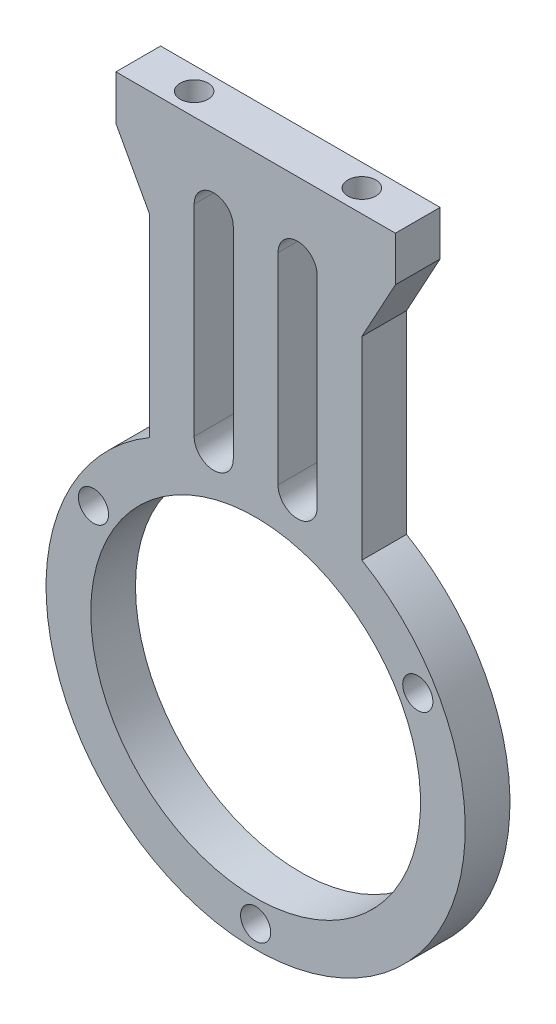
ISO-10303-21;
HEADER;
FILE_DESCRIPTION(('STEP AP214'),'2;1');
FILE_NAME('part.step','',(''),(''),'','','');
FILE_SCHEMA(('AUTOMOTIVE_DESIGN { 1 0 10303 214 1 1 1 1 }'));
ENDSEC;
DATA;
#1=APPLICATION_CONTEXT('core data for automotive mechanical design processes');
#2=APPLICATION_PROTOCOL_DEFINITION('international standard','automotive_design',2000,#1);
#3=PRODUCT_CONTEXT('',#1,'mechanical');
#4=PRODUCT('Part','Part','',(#3));
#5=PRODUCT_RELATED_PRODUCT_CATEGORY('part','',(#4));
#6=PRODUCT_DEFINITION_FORMATION('','',#4);
#7=PRODUCT_DEFINITION_CONTEXT('part definition',#1,'design');
#8=PRODUCT_DEFINITION('design','',#6,#7);
#9=PRODUCT_DEFINITION_SHAPE('','',#8);
#10=(LENGTH_UNIT() NAMED_UNIT(*) SI_UNIT(.MILLI.,.METRE.));
#11=(NAMED_UNIT(*) PLANE_ANGLE_UNIT() SI_UNIT($,.RADIAN.));
#12=(NAMED_UNIT(*) SI_UNIT($,.STERADIAN.) SOLID_ANGLE_UNIT());
#13=UNCERTAINTY_MEASURE_WITH_UNIT(LENGTH_MEASURE(1.E-05),#10,'distance_accuracy_value','');
#14=(GEOMETRIC_REPRESENTATION_CONTEXT(3) GLOBAL_UNCERTAINTY_ASSIGNED_CONTEXT((#13)) GLOBAL_UNIT_ASSIGNED_CONTEXT((#10,
#11,#12)) REPRESENTATION_CONTEXT('',''));
#15=CARTESIAN_POINT('',(0.,0.,0.));
#16=DIRECTION('',(0.,0.,1.));
#17=DIRECTION('',(1.,0.,0.));
#18=AXIS2_PLACEMENT_3D('',#15,#16,#17);
#19=CARTESIAN_POINT('',(7.5,38.,0.));
#20=DIRECTION('',(0.,1.,0.));
#21=DIRECTION('',(0.,0.,1.));
#22=AXIS2_PLACEMENT_3D('',#19,#20,#21);
#23=PLANE('',#22);
#24=CARTESIAN_POINT('',(7.5,38.,0.));
#25=DIRECTION('',(0.,-1.,0.));
#26=DIRECTION('',(0.,0.,-1.));
#27=AXIS2_PLACEMENT_3D('',#24,#25,#26);
#28=CIRCLE('',#27,1.25);
#29=CARTESIAN_POINT('',(7.5,38.,-1.25));
#30=VERTEX_POINT('',#29);
#31=EDGE_CURVE('E28',#30,#30,#28,.F.);
#32=ORIENTED_EDGE('',*,*,#31,.T.);
#33=EDGE_LOOP('',(#32));
#34=FACE_BOUND('',#33,.T.);
#35=ADVANCED_FACE('F25',(#34),#23,.T.);
#36=CARTESIAN_POINT('',(-7.5,38.,0.));
#37=DIRECTION('',(0.,1.,0.));
#38=DIRECTION('',(0.,0.,1.));
#39=AXIS2_PLACEMENT_3D('',#36,#37,#38);
#40=PLANE('',#39);
#41=CARTESIAN_POINT('',(-7.5,38.,0.));
#42=DIRECTION('',(0.,-1.,0.));
#43=DIRECTION('',(0.,0.,-1.));
#44=AXIS2_PLACEMENT_3D('',#41,#42,#43);
#45=CIRCLE('',#44,1.25);
#46=CARTESIAN_POINT('',(-7.5,38.,-1.25));
#47=VERTEX_POINT('',#46);
#48=EDGE_CURVE('E158',#47,#47,#45,.F.);
#49=ORIENTED_EDGE('',*,*,#48,.T.);
#50=EDGE_LOOP('',(#49));
#51=FACE_BOUND('',#50,.T.);
#52=ADVANCED_FACE('F283',(#51),#40,.T.);
#53=CARTESIAN_POINT('',(7.5,43.,0.));
#54=DIRECTION('',(0.,-1.,0.));
#55=DIRECTION('',(0.,0.,-1.));
#56=AXIS2_PLACEMENT_3D('',#53,#54,#55);
#57=CYLINDRICAL_SURFACE('',#56,1.25);
#58=ORIENTED_EDGE('',*,*,#31,.F.);
#59=EDGE_LOOP('',(#58));
#60=FACE_BOUND('',#59,.T.);
#61=CARTESIAN_POINT('',(7.5,43.,0.));
#62=DIRECTION('',(0.,-1.,0.));
#63=DIRECTION('',(0.,0.,-1.));
#64=AXIS2_PLACEMENT_3D('',#61,#62,#63);
#65=CIRCLE('',#64,1.25);
#66=CARTESIAN_POINT('',(7.5,43.,-1.25));
#67=VERTEX_POINT('',#66);
#68=EDGE_CURVE('E270',#67,#67,#65,.T.);
#69=ORIENTED_EDGE('',*,*,#68,.F.);
#70=EDGE_LOOP('',(#69));
#71=FACE_BOUND('',#70,.T.);
#72=ADVANCED_FACE('F279',(#60,#71),#57,.F.);
#73=CARTESIAN_POINT('',(-7.5,43.,0.));
#74=DIRECTION('',(0.,-1.,0.));
#75=DIRECTION('',(0.,0.,-1.));
#76=AXIS2_PLACEMENT_3D('',#73,#74,#75);
#77=CYLINDRICAL_SURFACE('',#76,1.25);
#78=ORIENTED_EDGE('',*,*,#48,.F.);
#79=EDGE_LOOP('',(#78));
#80=FACE_BOUND('',#79,.T.);
#81=CARTESIAN_POINT('',(-7.5,43.,0.));
#82=DIRECTION('',(0.,-1.,0.));
#83=DIRECTION('',(0.,0.,-1.));
#84=AXIS2_PLACEMENT_3D('',#81,#82,#83);
#85=CIRCLE('',#84,1.25);
#86=CARTESIAN_POINT('',(-7.5,43.,-1.25));
#87=VERTEX_POINT('',#86);
#88=EDGE_CURVE('E203',#87,#87,#85,.T.);
#89=ORIENTED_EDGE('',*,*,#88,.F.);
#90=EDGE_LOOP('',(#89));
#91=FACE_BOUND('',#90,.T.);
#92=ADVANCED_FACE('F282',(#80,#91),#77,.F.);
#93=CARTESIAN_POINT('',(0.,12.125,2.));
#94=DIRECTION('',(0.,0.,1.));
#95=DIRECTION('',(1.,0.,0.));
#96=AXIS2_PLACEMENT_3D('',#93,#94,#95);
#97=PLANE('',#96);
#98=DIRECTION('',(0.,1.,0.));
#99=VECTOR('',#98,1.);
#100=CARTESIAN_POINT('',(-5.5,18.25,2.));
#101=LINE('',#100,#99);
#102=CARTESIAN_POINT('',(-5.5,18.25,2.));
#103=VERTEX_POINT('',#102);
#104=CARTESIAN_POINT('',(-5.5,36.25,2.));
#105=VERTEX_POINT('',#104);
#106=EDGE_CURVE('E176',#103,#105,#101,.T.);
#107=ORIENTED_EDGE('',*,*,#106,.T.);
#108=CARTESIAN_POINT('',(-3.75,36.25,2.));
#109=DIRECTION('',(0.,0.,-1.));
#110=DIRECTION('',(-1.,0.,0.));
#111=AXIS2_PLACEMENT_3D('',#108,#109,#110);
#112=CIRCLE('',#111,1.75);
#113=CARTESIAN_POINT('',(-2.,36.25,2.));
#114=VERTEX_POINT('',#113);
#115=EDGE_CURVE('E245',#105,#114,#112,.T.);
#116=ORIENTED_EDGE('',*,*,#115,.T.);
#117=DIRECTION('',(0.,1.,0.));
#118=VECTOR('',#117,1.);
#119=CARTESIAN_POINT('',(-2.,36.25,2.));
#120=LINE('',#119,#118);
#121=CARTESIAN_POINT('',(-2.,18.25,2.));
#122=VERTEX_POINT('',#121);
#123=EDGE_CURVE('E172',#114,#122,#120,.F.);
#124=ORIENTED_EDGE('',*,*,#123,.T.);
#125=CARTESIAN_POINT('',(-3.75,18.25,2.));
#126=DIRECTION('',(0.,0.,-1.));
#127=DIRECTION('',(-1.,0.,0.));
#128=AXIS2_PLACEMENT_3D('',#125,#126,#127);
#129=CIRCLE('',#128,1.75);
#130=EDGE_CURVE('E247',#122,#103,#129,.T.);
#131=ORIENTED_EDGE('',*,*,#130,.T.);
#132=EDGE_LOOP('',(#107,#116,#124,#131));
#133=FACE_BOUND('',#132,.T.);
#134=DIRECTION('',(0.,1.,0.));
#135=VECTOR('',#134,1.);
#136=CARTESIAN_POINT('',(2.,18.25,2.));
#137=LINE('',#136,#135);
#138=CARTESIAN_POINT('',(2.,18.25,2.));
#139=VERTEX_POINT('',#138);
#140=CARTESIAN_POINT('',(2.,36.25,2.));
#141=VERTEX_POINT('',#140);
#142=EDGE_CURVE('E185',#139,#141,#137,.T.);
#143=ORIENTED_EDGE('',*,*,#142,.T.);
#144=CARTESIAN_POINT('',(3.75,36.25,2.));
#145=DIRECTION('',(0.,0.,-1.));
#146=DIRECTION('',(-1.,0.,0.));
#147=AXIS2_PLACEMENT_3D('',#144,#145,#146);
#148=CIRCLE('',#147,1.75);
#149=CARTESIAN_POINT('',(5.5,36.25,2.));
#150=VERTEX_POINT('',#149);
#151=EDGE_CURVE('E249',#141,#150,#148,.T.);
#152=ORIENTED_EDGE('',*,*,#151,.T.);
#153=DIRECTION('',(0.,1.,0.));
#154=VECTOR('',#153,1.);
#155=CARTESIAN_POINT('',(5.5,36.25,2.));
#156=LINE('',#155,#154);
#157=CARTESIAN_POINT('',(5.5,18.25,2.));
#158=VERTEX_POINT('',#157);
#159=EDGE_CURVE('E180',#150,#158,#156,.F.);
#160=ORIENTED_EDGE('',*,*,#159,.T.);
#161=CARTESIAN_POINT('',(3.75,18.25,2.));
#162=DIRECTION('',(0.,0.,-1.));
#163=DIRECTION('',(-1.,0.,0.));
#164=AXIS2_PLACEMENT_3D('',#161,#162,#163);
#165=CIRCLE('',#164,1.75);
#166=EDGE_CURVE('E251',#158,#139,#165,.T.);
#167=ORIENTED_EDGE('',*,*,#166,.T.);
#168=EDGE_LOOP('',(#143,#152,#160,#167));
#169=FACE_BOUND('',#168,.T.);
#170=CARTESIAN_POINT('',(0.,0.,2.));
#171=DIRECTION('',(0.,0.,-1.));
#172=DIRECTION('',(-1.,0.,0.));
#173=AXIS2_PLACEMENT_3D('',#170,#171,#172);
#174=CIRCLE('',#173,14.75);
#175=CARTESIAN_POINT('',(-14.75,0.,2.));
#176=VERTEX_POINT('',#175);
#177=EDGE_CURVE('E253',#176,#176,#174,.T.);
#178=ORIENTED_EDGE('',*,*,#177,.T.);
#179=EDGE_LOOP('',(#178));
#180=FACE_BOUND('',#179,.T.);
#181=CARTESIAN_POINT('',(-14.5059255133894,8.375,2.));
#182=DIRECTION('',(0.,0.,-1.));
#183=DIRECTION('',(-1.,0.,0.));
#184=AXIS2_PLACEMENT_3D('',#181,#182,#183);
#185=CIRCLE('',#184,1.35);
#186=CARTESIAN_POINT('',(-15.8559255133894,8.375,2.));
#187=VERTEX_POINT('',#186);
#188=EDGE_CURVE('E256',#187,#187,#185,.T.);
#189=ORIENTED_EDGE('',*,*,#188,.T.);
#190=EDGE_LOOP('',(#189));
#191=FACE_BOUND('',#190,.T.);
#192=CARTESIAN_POINT('',(0.,-16.75,2.));
#193=DIRECTION('',(0.,0.,-1.));
#194=DIRECTION('',(-1.,0.,0.));
#195=AXIS2_PLACEMENT_3D('',#192,#193,#194);
#196=CIRCLE('',#195,1.35);
#197=CARTESIAN_POINT('',(-1.35,-16.75,2.));
#198=VERTEX_POINT('',#197);
#199=EDGE_CURVE('E259',#198,#198,#196,.T.);
#200=ORIENTED_EDGE('',*,*,#199,.T.);
#201=EDGE_LOOP('',(#200));
#202=FACE_BOUND('',#201,.T.);
#203=CARTESIAN_POINT('',(14.5059255133894,8.375,2.));
#204=DIRECTION('',(0.,0.,-1.));
#205=DIRECTION('',(-1.,0.,0.));
#206=AXIS2_PLACEMENT_3D('',#203,#204,#205);
#207=CIRCLE('',#206,1.35);
#208=CARTESIAN_POINT('',(13.1559255133894,8.375,2.));
#209=VERTEX_POINT('',#208);
#210=EDGE_CURVE('E262',#209,#209,#207,.T.);
#211=ORIENTED_EDGE('',*,*,#210,.T.);
#212=EDGE_LOOP('',(#211));
#213=FACE_BOUND('',#212,.T.);
#214=DIRECTION('',(0.478852130680573,-0.877895572914385,0.));
#215=VECTOR('',#214,1.);
#216=CARTESIAN_POINT('',(-12.5,39.,2.));
#217=LINE('',#216,#215);
#218=CARTESIAN_POINT('',(-9.5,33.5,2.));
#219=VERTEX_POINT('',#218);
#220=CARTESIAN_POINT('',(-12.5,39.,2.));
#221=VERTEX_POINT('',#220);
#222=EDGE_CURVE('E196',#219,#221,#217,.F.);
#223=ORIENTED_EDGE('',*,*,#222,.F.);
#224=DIRECTION('',(0.,-1.,0.));
#225=VECTOR('',#224,1.);
#226=CARTESIAN_POINT('',(-9.5,33.5,2.));
#227=LINE('',#226,#225);
#228=CARTESIAN_POINT('',(-9.5,16.1651631603272,2.));
#229=VERTEX_POINT('',#228);
#230=EDGE_CURVE('E114',#229,#219,#227,.F.);
#231=ORIENTED_EDGE('',*,*,#230,.F.);
#232=CARTESIAN_POINT('',(0.,0.,2.));
#233=DIRECTION('',(0.,0.,1.));
#234=DIRECTION('',(1.,0.,0.));
#235=AXIS2_PLACEMENT_3D('',#232,#233,#234);
#236=CIRCLE('',#235,18.75);
#237=CARTESIAN_POINT('',(9.5,16.1651631603272,2.));
#238=VERTEX_POINT('',#237);
#239=EDGE_CURVE('E157',#238,#229,#236,.F.);
#240=ORIENTED_EDGE('',*,*,#239,.F.);
#241=DIRECTION('',(0.,1.,0.));
#242=VECTOR('',#241,1.);
#243=CARTESIAN_POINT('',(9.5,16.1651631603272,2.));
#244=LINE('',#243,#242);
#245=CARTESIAN_POINT('',(9.5,33.5,2.));
#246=VERTEX_POINT('',#245);
#247=EDGE_CURVE('E104',#246,#238,#244,.F.);
#248=ORIENTED_EDGE('',*,*,#247,.F.);
#249=DIRECTION('',(0.478852130680573,0.877895572914385,0.));
#250=VECTOR('',#249,1.);
#251=CARTESIAN_POINT('',(9.5,33.5,2.));
#252=LINE('',#251,#250);
#253=CARTESIAN_POINT('',(12.5,39.,2.));
#254=VERTEX_POINT('',#253);
#255=EDGE_CURVE('E146',#254,#246,#252,.F.);
#256=ORIENTED_EDGE('',*,*,#255,.F.);
#257=DIRECTION('',(0.,1.,0.));
#258=VECTOR('',#257,1.);
#259=CARTESIAN_POINT('',(12.5,39.,2.));
#260=LINE('',#259,#258);
#261=CARTESIAN_POINT('',(12.5,43.,2.));
#262=VERTEX_POINT('',#261);
#263=EDGE_CURVE('E163',#262,#254,#260,.F.);
#264=ORIENTED_EDGE('',*,*,#263,.F.);
#265=DIRECTION('',(1.,0.,0.));
#266=VECTOR('',#265,1.);
#267=CARTESIAN_POINT('',(12.5,43.,2.));
#268=LINE('',#267,#266);
#269=CARTESIAN_POINT('',(-12.5,43.,2.));
#270=VERTEX_POINT('',#269);
#271=EDGE_CURVE('E206',#270,#262,#268,.T.);
#272=ORIENTED_EDGE('',*,*,#271,.F.);
#273=DIRECTION('',(0.,1.,0.));
#274=VECTOR('',#273,1.);
#275=CARTESIAN_POINT('',(-12.5,43.,2.));
#276=LINE('',#275,#274);
#277=EDGE_CURVE('E201',#221,#270,#276,.T.);
#278=ORIENTED_EDGE('',*,*,#277,.F.);
#279=EDGE_LOOP('',(#223,#231,#240,#248,#256,#264,#272,#278));
#280=FACE_BOUND('',#279,.T.);
#281=ADVANCED_FACE('F156',(#133,#169,#180,#191,#202,#213,#280),#97,.T.);
#282=CARTESIAN_POINT('',(9.5,16.1651631603272,0.));
#283=DIRECTION('',(1.,0.,0.));
#284=DIRECTION('',(0.,1.,0.));
#285=AXIS2_PLACEMENT_3D('',#282,#283,#284);
#286=PLANE('',#285);
#287=DIRECTION('',(0.,0.,1.));
#288=VECTOR('',#287,1.);
#289=CARTESIAN_POINT('',(9.5,16.1651631603272,0.));
#290=LINE('',#289,#288);
#291=CARTESIAN_POINT('',(9.5,16.1651631603272,-2.));
#292=VERTEX_POINT('',#291);
#293=EDGE_CURVE('E267',#292,#238,#290,.T.);
#294=ORIENTED_EDGE('',*,*,#293,.F.);
#295=DIRECTION('',(0.,1.,0.));
#296=VECTOR('',#295,1.);
#297=CARTESIAN_POINT('',(9.5,12.125,-2.));
#298=LINE('',#297,#296);
#299=CARTESIAN_POINT('',(9.5,33.5,-2.));
#300=VERTEX_POINT('',#299);
#301=EDGE_CURVE('E162',#292,#300,#298,.T.);
#302=ORIENTED_EDGE('',*,*,#301,.T.);
#303=DIRECTION('',(0.,0.,1.));
#304=VECTOR('',#303,1.);
#305=CARTESIAN_POINT('',(9.5,33.5,0.));
#306=LINE('',#305,#304);
#307=EDGE_CURVE('E149',#246,#300,#306,.F.);
#308=ORIENTED_EDGE('',*,*,#307,.F.);
#309=ORIENTED_EDGE('',*,*,#247,.T.);
#310=EDGE_LOOP('',(#294,#302,#308,#309));
#311=FACE_BOUND('',#310,.T.);
#312=ADVANCED_FACE('F161',(#311),#286,.T.);
#313=CARTESIAN_POINT('',(9.5,33.5,0.));
#314=DIRECTION('',(0.877895572914385,-0.478852130680573,0.));
#315=DIRECTION('',(0.478852130680573,0.877895572914385,0.));
#316=AXIS2_PLACEMENT_3D('',#313,#314,#315);
#317=PLANE('',#316);
#318=ORIENTED_EDGE('',*,*,#307,.T.);
#319=DIRECTION('',(0.478852130680574,0.877895572914384,0.));
#320=VECTOR('',#319,1.);
#321=CARTESIAN_POINT('',(9.5,33.5,-2.));
#322=LINE('',#321,#320);
#323=CARTESIAN_POINT('',(12.5,39.,-2.));
#324=VERTEX_POINT('',#323);
#325=EDGE_CURVE('E313',#300,#324,#322,.T.);
#326=ORIENTED_EDGE('',*,*,#325,.T.);
#327=DIRECTION('',(0.,0.,-1.));
#328=VECTOR('',#327,1.);
#329=CARTESIAN_POINT('',(12.5,39.,0.));
#330=LINE('',#329,#328);
#331=EDGE_CURVE('E151',#254,#324,#330,.T.);
#332=ORIENTED_EDGE('',*,*,#331,.F.);
#333=ORIENTED_EDGE('',*,*,#255,.T.);
#334=EDGE_LOOP('',(#318,#326,#332,#333));
#335=FACE_BOUND('',#334,.T.);
#336=ADVANCED_FACE('F147',(#335),#317,.T.);
#337=CARTESIAN_POINT('',(12.5,39.,0.));
#338=DIRECTION('',(1.,0.,0.));
#339=DIRECTION('',(0.,0.,-1.));
#340=AXIS2_PLACEMENT_3D('',#337,#338,#339);
#341=PLANE('',#340);
#342=ORIENTED_EDGE('',*,*,#331,.T.);
#343=DIRECTION('',(0.,1.,0.));
#344=VECTOR('',#343,1.);
#345=CARTESIAN_POINT('',(12.5,12.125,-2.));
#346=LINE('',#345,#344);
#347=CARTESIAN_POINT('',(12.5,43.,-2.));
#348=VERTEX_POINT('',#347);
#349=EDGE_CURVE('E308',#324,#348,#346,.T.);
#350=ORIENTED_EDGE('',*,*,#349,.T.);
#351=DIRECTION('',(0.,0.,1.));
#352=VECTOR('',#351,1.);
#353=CARTESIAN_POINT('',(12.5,43.,0.));
#354=LINE('',#353,#352);
#355=EDGE_CURVE('E208',#262,#348,#354,.F.);
#356=ORIENTED_EDGE('',*,*,#355,.F.);
#357=ORIENTED_EDGE('',*,*,#263,.T.);
#358=EDGE_LOOP('',(#342,#350,#356,#357));
#359=FACE_BOUND('',#358,.T.);
#360=ADVANCED_FACE('F291',(#359),#341,.T.);
#361=CARTESIAN_POINT('',(12.5,43.,0.));
#362=DIRECTION('',(0.,1.,0.));
#363=DIRECTION('',(0.,0.,1.));
#364=AXIS2_PLACEMENT_3D('',#361,#362,#363);
#365=PLANE('',#364);
#366=ORIENTED_EDGE('',*,*,#88,.T.);
#367=EDGE_LOOP('',(#366));
#368=FACE_BOUND('',#367,.T.);
#369=ORIENTED_EDGE('',*,*,#68,.T.);
#370=EDGE_LOOP('',(#369));
#371=FACE_BOUND('',#370,.T.);
#372=ORIENTED_EDGE('',*,*,#355,.T.);
#373=DIRECTION('',(1.,0.,0.));
#374=VECTOR('',#373,1.);
#375=CARTESIAN_POINT('',(0.,43.,-2.));
#376=LINE('',#375,#374);
#377=CARTESIAN_POINT('',(-12.5,43.,-2.));
#378=VERTEX_POINT('',#377);
#379=EDGE_CURVE('E298',#348,#378,#376,.F.);
#380=ORIENTED_EDGE('',*,*,#379,.T.);
#381=DIRECTION('',(0.,0.,1.));
#382=VECTOR('',#381,1.);
#383=CARTESIAN_POINT('',(-12.5,43.,0.));
#384=LINE('',#383,#382);
#385=EDGE_CURVE('E198',#270,#378,#384,.F.);
#386=ORIENTED_EDGE('',*,*,#385,.F.);
#387=ORIENTED_EDGE('',*,*,#271,.T.);
#388=EDGE_LOOP('',(#372,#380,#386,#387));
#389=FACE_BOUND('',#388,.T.);
#390=ADVANCED_FACE('F287',(#368,#371,#389),#365,.T.);
#391=CARTESIAN_POINT('',(-12.5,43.,0.));
#392=DIRECTION('',(-1.,0.,0.));
#393=DIRECTION('',(0.,0.,1.));
#394=AXIS2_PLACEMENT_3D('',#391,#392,#393);
#395=PLANE('',#394);
#396=ORIENTED_EDGE('',*,*,#385,.T.);
#397=DIRECTION('',(0.,1.,0.));
#398=VECTOR('',#397,1.);
#399=CARTESIAN_POINT('',(-12.5,12.125,-2.));
#400=LINE('',#399,#398);
#401=CARTESIAN_POINT('',(-12.5,39.,-2.));
#402=VERTEX_POINT('',#401);
#403=EDGE_CURVE('E311',#378,#402,#400,.F.);
#404=ORIENTED_EDGE('',*,*,#403,.T.);
#405=DIRECTION('',(0.,0.,1.));
#406=VECTOR('',#405,1.);
#407=CARTESIAN_POINT('',(-12.5,39.,0.));
#408=LINE('',#407,#406);
#409=EDGE_CURVE('E191',#221,#402,#408,.F.);
#410=ORIENTED_EDGE('',*,*,#409,.F.);
#411=ORIENTED_EDGE('',*,*,#277,.T.);
#412=EDGE_LOOP('',(#396,#404,#410,#411));
#413=FACE_BOUND('',#412,.T.);
#414=ADVANCED_FACE('F290',(#413),#395,.T.);
#415=CARTESIAN_POINT('',(-12.5,39.,0.));
#416=DIRECTION('',(-0.877895572914385,-0.478852130680573,0.));
#417=DIRECTION('',(0.478852130680573,-0.877895572914385,0.));
#418=AXIS2_PLACEMENT_3D('',#415,#416,#417);
#419=PLANE('',#418);
#420=ORIENTED_EDGE('',*,*,#409,.T.);
#421=DIRECTION('',(0.478852130680574,-0.877895572914384,0.));
#422=VECTOR('',#421,1.);
#423=CARTESIAN_POINT('',(-12.5,39.,-2.));
#424=LINE('',#423,#422);
#425=CARTESIAN_POINT('',(-9.5,33.5,-2.));
#426=VERTEX_POINT('',#425);
#427=EDGE_CURVE('E331',#402,#426,#424,.T.);
#428=ORIENTED_EDGE('',*,*,#427,.T.);
#429=DIRECTION('',(0.,0.,1.));
#430=VECTOR('',#429,1.);
#431=CARTESIAN_POINT('',(-9.5,33.5,0.));
#432=LINE('',#431,#430);
#433=EDGE_CURVE('E190',#219,#426,#432,.F.);
#434=ORIENTED_EDGE('',*,*,#433,.F.);
#435=ORIENTED_EDGE('',*,*,#222,.T.);
#436=EDGE_LOOP('',(#420,#428,#434,#435));
#437=FACE_BOUND('',#436,.T.);
#438=ADVANCED_FACE('F553',(#437),#419,.T.);
#439=CARTESIAN_POINT('',(-9.5,33.5,0.));
#440=DIRECTION('',(-1.,0.,0.));
#441=DIRECTION('',(0.,-1.,0.));
#442=AXIS2_PLACEMENT_3D('',#439,#440,#441);
#443=PLANE('',#442);
#444=ORIENTED_EDGE('',*,*,#433,.T.);
#445=DIRECTION('',(0.,1.,0.));
#446=VECTOR('',#445,1.);
#447=CARTESIAN_POINT('',(-9.5,12.125,-2.));
#448=LINE('',#447,#446);
#449=CARTESIAN_POINT('',(-9.5,16.1651631603272,-2.));
#450=VERTEX_POINT('',#449);
#451=EDGE_CURVE('E244',#426,#450,#448,.F.);
#452=ORIENTED_EDGE('',*,*,#451,.T.);
#453=DIRECTION('',(0.,0.,1.));
#454=VECTOR('',#453,1.);
#455=CARTESIAN_POINT('',(-9.5,16.1651631603272,0.));
#456=LINE('',#455,#454);
#457=EDGE_CURVE('E265',#229,#450,#456,.F.);
#458=ORIENTED_EDGE('',*,*,#457,.F.);
#459=ORIENTED_EDGE('',*,*,#230,.T.);
#460=EDGE_LOOP('',(#444,#452,#458,#459));
#461=FACE_BOUND('',#460,.T.);
#462=ADVANCED_FACE('F415',(#461),#443,.T.);
#463=CARTESIAN_POINT('',(0.,0.,0.));
#464=DIRECTION('',(0.,0.,1.));
#465=DIRECTION('',(1.,0.,0.));
#466=AXIS2_PLACEMENT_3D('',#463,#464,#465);
#467=CYLINDRICAL_SURFACE('',#466,18.75);
#468=ORIENTED_EDGE('',*,*,#457,.T.);
#469=CARTESIAN_POINT('',(0.,0.,-2.));
#470=DIRECTION('',(0.,0.,1.));
#471=DIRECTION('',(1.,0.,0.));
#472=AXIS2_PLACEMENT_3D('',#469,#470,#471);
#473=CIRCLE('',#472,18.75);
#474=EDGE_CURVE('E241',#450,#292,#473,.T.);
#475=ORIENTED_EDGE('',*,*,#474,.T.);
#476=ORIENTED_EDGE('',*,*,#293,.T.);
#477=ORIENTED_EDGE('',*,*,#239,.T.);
#478=EDGE_LOOP('',(#468,#475,#476,#477));
#479=FACE_BOUND('',#478,.T.);
#480=ADVANCED_FACE('F404',(#479),#467,.T.);
#481=CARTESIAN_POINT('',(14.5059255133894,8.375,2.));
#482=DIRECTION('',(0.,0.,-1.));
#483=DIRECTION('',(-1.,0.,0.));
#484=AXIS2_PLACEMENT_3D('',#481,#482,#483);
#485=CYLINDRICAL_SURFACE('',#484,1.35);
#486=CARTESIAN_POINT('',(14.5059255133894,8.375,-2.));
#487=DIRECTION('',(0.,0.,-1.));
#488=DIRECTION('',(-1.,0.,0.));
#489=AXIS2_PLACEMENT_3D('',#486,#487,#488);
#490=CIRCLE('',#489,1.35);
#491=CARTESIAN_POINT('',(13.1559255133894,8.375,-2.));
#492=VERTEX_POINT('',#491);
#493=EDGE_CURVE('E238',#492,#492,#490,.T.);
#494=ORIENTED_EDGE('',*,*,#493,.T.);
#495=EDGE_LOOP('',(#494));
#496=FACE_BOUND('',#495,.T.);
#497=ORIENTED_EDGE('',*,*,#210,.F.);
#498=EDGE_LOOP('',(#497));
#499=FACE_BOUND('',#498,.T.);
#500=ADVANCED_FACE('F401',(#496,#499),#485,.F.);
#501=CARTESIAN_POINT('',(0.,-16.75,2.));
#502=DIRECTION('',(0.,0.,-1.));
#503=DIRECTION('',(-1.,0.,0.));
#504=AXIS2_PLACEMENT_3D('',#501,#502,#503);
#505=CYLINDRICAL_SURFACE('',#504,1.35);
#506=CARTESIAN_POINT('',(0.,-16.75,-2.));
#507=DIRECTION('',(0.,0.,-1.));
#508=DIRECTION('',(-1.,0.,0.));
#509=AXIS2_PLACEMENT_3D('',#506,#507,#508);
#510=CIRCLE('',#509,1.35);
#511=CARTESIAN_POINT('',(-1.35,-16.75,-2.));
#512=VERTEX_POINT('',#511);
#513=EDGE_CURVE('E235',#512,#512,#510,.T.);
#514=ORIENTED_EDGE('',*,*,#513,.T.);
#515=EDGE_LOOP('',(#514));
#516=FACE_BOUND('',#515,.T.);
#517=ORIENTED_EDGE('',*,*,#199,.F.);
#518=EDGE_LOOP('',(#517));
#519=FACE_BOUND('',#518,.T.);
#520=ADVANCED_FACE('F403',(#516,#519),#505,.F.);
#521=CARTESIAN_POINT('',(-14.5059255133894,8.375,2.));
#522=DIRECTION('',(0.,0.,-1.));
#523=DIRECTION('',(-1.,0.,0.));
#524=AXIS2_PLACEMENT_3D('',#521,#522,#523);
#525=CYLINDRICAL_SURFACE('',#524,1.35);
#526=CARTESIAN_POINT('',(-14.5059255133894,8.375,-2.));
#527=DIRECTION('',(0.,0.,-1.));
#528=DIRECTION('',(-1.,0.,0.));
#529=AXIS2_PLACEMENT_3D('',#526,#527,#528);
#530=CIRCLE('',#529,1.35);
#531=CARTESIAN_POINT('',(-15.8559255133894,8.375,-2.));
#532=VERTEX_POINT('',#531);
#533=EDGE_CURVE('E232',#532,#532,#530,.T.);
#534=ORIENTED_EDGE('',*,*,#533,.T.);
#535=EDGE_LOOP('',(#534));
#536=FACE_BOUND('',#535,.T.);
#537=ORIENTED_EDGE('',*,*,#188,.F.);
#538=EDGE_LOOP('',(#537));
#539=FACE_BOUND('',#538,.T.);
#540=ADVANCED_FACE('F412',(#536,#539),#525,.F.);
#541=CARTESIAN_POINT('',(0.,0.,2.));
#542=DIRECTION('',(0.,0.,-1.));
#543=DIRECTION('',(-1.,0.,0.));
#544=AXIS2_PLACEMENT_3D('',#541,#542,#543);
#545=CYLINDRICAL_SURFACE('',#544,14.75);
#546=CARTESIAN_POINT('',(0.,0.,-2.));
#547=DIRECTION('',(0.,0.,-1.));
#548=DIRECTION('',(-1.,0.,0.));
#549=AXIS2_PLACEMENT_3D('',#546,#547,#548);
#550=CIRCLE('',#549,14.75);
#551=CARTESIAN_POINT('',(-14.75,0.,-2.));
#552=VERTEX_POINT('',#551);
#553=EDGE_CURVE('E229',#552,#552,#550,.T.);
#554=ORIENTED_EDGE('',*,*,#553,.T.);
#555=EDGE_LOOP('',(#554));
#556=FACE_BOUND('',#555,.T.);
#557=ORIENTED_EDGE('',*,*,#177,.F.);
#558=EDGE_LOOP('',(#557));
#559=FACE_BOUND('',#558,.T.);
#560=ADVANCED_FACE('F446',(#556,#559),#545,.F.);
#561=CARTESIAN_POINT('',(3.75,18.25,2.));
#562=DIRECTION('',(0.,0.,-1.));
#563=DIRECTION('',(-1.,0.,0.));
#564=AXIS2_PLACEMENT_3D('',#561,#562,#563);
#565=CYLINDRICAL_SURFACE('',#564,1.75);
#566=DIRECTION('',(0.,0.,1.));
#567=VECTOR('',#566,1.);
#568=CARTESIAN_POINT('',(2.,18.25,2.));
#569=LINE('',#568,#567);
#570=CARTESIAN_POINT('',(2.,18.25,-2.));
#571=VERTEX_POINT('',#570);
#572=EDGE_CURVE('E188',#571,#139,#569,.T.);
#573=ORIENTED_EDGE('',*,*,#572,.T.);
#574=ORIENTED_EDGE('',*,*,#166,.F.);
#575=DIRECTION('',(0.,0.,-1.));
#576=VECTOR('',#575,1.);
#577=CARTESIAN_POINT('',(5.5,18.25,2.));
#578=LINE('',#577,#576);
#579=CARTESIAN_POINT('',(5.5,18.25,-2.));
#580=VERTEX_POINT('',#579);
#581=EDGE_CURVE('E183',#158,#580,#578,.T.);
#582=ORIENTED_EDGE('',*,*,#581,.T.);
#583=CARTESIAN_POINT('',(3.75,18.25,-2.));
#584=DIRECTION('',(0.,0.,-1.));
#585=DIRECTION('',(-1.,0.,0.));
#586=AXIS2_PLACEMENT_3D('',#583,#584,#585);
#587=CIRCLE('',#586,1.75);
#588=EDGE_CURVE('E226',#580,#571,#587,.T.);
#589=ORIENTED_EDGE('',*,*,#588,.T.);
#590=EDGE_LOOP('',(#573,#574,#582,#589));
#591=FACE_BOUND('',#590,.T.);
#592=ADVANCED_FACE('F442',(#591),#565,.F.);
#593=CARTESIAN_POINT('',(2.,18.25,2.));
#594=DIRECTION('',(-1.,0.,0.));
#595=DIRECTION('',(0.,0.,1.));
#596=AXIS2_PLACEMENT_3D('',#593,#594,#595);
#597=PLANE('',#596);
#598=DIRECTION('',(0.,0.,-1.));
#599=VECTOR('',#598,1.);
#600=CARTESIAN_POINT('',(2.,36.25,2.));
#601=LINE('',#600,#599);
#602=CARTESIAN_POINT('',(2.,36.25,-2.));
#603=VERTEX_POINT('',#602);
#604=EDGE_CURVE('E187',#603,#141,#601,.F.);
#605=ORIENTED_EDGE('',*,*,#604,.T.);
#606=ORIENTED_EDGE('',*,*,#142,.F.);
#607=ORIENTED_EDGE('',*,*,#572,.F.);
#608=DIRECTION('',(0.,1.,0.));
#609=VECTOR('',#608,1.);
#610=CARTESIAN_POINT('',(2.,12.125,-2.));
#611=LINE('',#610,#609);
#612=EDGE_CURVE('E225',#571,#603,#611,.T.);
#613=ORIENTED_EDGE('',*,*,#612,.T.);
#614=EDGE_LOOP('',(#605,#606,#607,#613));
#615=FACE_BOUND('',#614,.T.);
#616=ADVANCED_FACE('F438',(#615),#597,.F.);
#617=CARTESIAN_POINT('',(3.75,36.25,2.));
#618=DIRECTION('',(0.,0.,-1.));
#619=DIRECTION('',(-1.,0.,0.));
#620=AXIS2_PLACEMENT_3D('',#617,#618,#619);
#621=CYLINDRICAL_SURFACE('',#620,1.75);
#622=DIRECTION('',(0.,0.,-1.));
#623=VECTOR('',#622,1.);
#624=CARTESIAN_POINT('',(5.5,36.25,2.));
#625=LINE('',#624,#623);
#626=CARTESIAN_POINT('',(5.5,36.25,-2.));
#627=VERTEX_POINT('',#626);
#628=EDGE_CURVE('E184',#627,#150,#625,.F.);
#629=ORIENTED_EDGE('',*,*,#628,.T.);
#630=ORIENTED_EDGE('',*,*,#151,.F.);
#631=ORIENTED_EDGE('',*,*,#604,.F.);
#632=CARTESIAN_POINT('',(3.75,36.25,-2.));
#633=DIRECTION('',(0.,0.,-1.));
#634=DIRECTION('',(-1.,0.,0.));
#635=AXIS2_PLACEMENT_3D('',#632,#633,#634);
#636=CIRCLE('',#635,1.75);
#637=EDGE_CURVE('E222',#603,#627,#636,.T.);
#638=ORIENTED_EDGE('',*,*,#637,.T.);
#639=EDGE_LOOP('',(#629,#630,#631,#638));
#640=FACE_BOUND('',#639,.T.);
#641=ADVANCED_FACE('F434',(#640),#621,.F.);
#642=CARTESIAN_POINT('',(5.5,36.25,2.));
#643=DIRECTION('',(1.,0.,0.));
#644=DIRECTION('',(0.,0.,-1.));
#645=AXIS2_PLACEMENT_3D('',#642,#643,#644);
#646=PLANE('',#645);
#647=ORIENTED_EDGE('',*,*,#581,.F.);
#648=ORIENTED_EDGE('',*,*,#159,.F.);
#649=ORIENTED_EDGE('',*,*,#628,.F.);
#650=DIRECTION('',(0.,1.,0.));
#651=VECTOR('',#650,1.);
#652=CARTESIAN_POINT('',(5.5,12.125,-2.));
#653=LINE('',#652,#651);
#654=EDGE_CURVE('E221',#627,#580,#653,.F.);
#655=ORIENTED_EDGE('',*,*,#654,.T.);
#656=EDGE_LOOP('',(#647,#648,#649,#655));
#657=FACE_BOUND('',#656,.T.);
#658=ADVANCED_FACE('F431',(#657),#646,.F.);
#659=CARTESIAN_POINT('',(-3.75,18.25,2.));
#660=DIRECTION('',(0.,0.,-1.));
#661=DIRECTION('',(-1.,0.,0.));
#662=AXIS2_PLACEMENT_3D('',#659,#660,#661);
#663=CYLINDRICAL_SURFACE('',#662,1.75);
#664=DIRECTION('',(0.,0.,1.));
#665=VECTOR('',#664,1.);
#666=CARTESIAN_POINT('',(-5.5,18.25,2.));
#667=LINE('',#666,#665);
#668=CARTESIAN_POINT('',(-5.5,18.25,-2.));
#669=VERTEX_POINT('',#668);
#670=EDGE_CURVE('E179',#669,#103,#667,.T.);
#671=ORIENTED_EDGE('',*,*,#670,.T.);
#672=ORIENTED_EDGE('',*,*,#130,.F.);
#673=DIRECTION('',(0.,0.,-1.));
#674=VECTOR('',#673,1.);
#675=CARTESIAN_POINT('',(-2.,18.25,2.));
#676=LINE('',#675,#674);
#677=CARTESIAN_POINT('',(-2.,18.25,-2.));
#678=VERTEX_POINT('',#677);
#679=EDGE_CURVE('E175',#122,#678,#676,.T.);
#680=ORIENTED_EDGE('',*,*,#679,.T.);
#681=CARTESIAN_POINT('',(-3.75,18.25,-2.));
#682=DIRECTION('',(0.,0.,-1.));
#683=DIRECTION('',(-1.,0.,0.));
#684=AXIS2_PLACEMENT_3D('',#681,#682,#683);
#685=CIRCLE('',#684,1.75);
#686=EDGE_CURVE('E218',#678,#669,#685,.T.);
#687=ORIENTED_EDGE('',*,*,#686,.T.);
#688=EDGE_LOOP('',(#671,#672,#680,#687));
#689=FACE_BOUND('',#688,.T.);
#690=ADVANCED_FACE('F380',(#689),#663,.F.);
#691=CARTESIAN_POINT('',(-5.5,18.25,2.));
#692=DIRECTION('',(-1.,0.,0.));
#693=DIRECTION('',(0.,0.,1.));
#694=AXIS2_PLACEMENT_3D('',#691,#692,#693);
#695=PLANE('',#694);
#696=DIRECTION('',(0.,0.,-1.));
#697=VECTOR('',#696,1.);
#698=CARTESIAN_POINT('',(-5.5,36.25,2.));
#699=LINE('',#698,#697);
#700=CARTESIAN_POINT('',(-5.5,36.25,-2.));
#701=VERTEX_POINT('',#700);
#702=EDGE_CURVE('E178',#701,#105,#699,.F.);
#703=ORIENTED_EDGE('',*,*,#702,.T.);
#704=ORIENTED_EDGE('',*,*,#106,.F.);
#705=ORIENTED_EDGE('',*,*,#670,.F.);
#706=DIRECTION('',(0.,1.,0.));
#707=VECTOR('',#706,1.);
#708=CARTESIAN_POINT('',(-5.5,12.125,-2.));
#709=LINE('',#708,#707);
#710=EDGE_CURVE('E217',#669,#701,#709,.T.);
#711=ORIENTED_EDGE('',*,*,#710,.T.);
#712=EDGE_LOOP('',(#703,#704,#705,#711));
#713=FACE_BOUND('',#712,.T.);
#714=ADVANCED_FACE('F374',(#713),#695,.F.);
#715=CARTESIAN_POINT('',(-3.75,36.25,2.));
#716=DIRECTION('',(0.,0.,-1.));
#717=DIRECTION('',(-1.,0.,0.));
#718=AXIS2_PLACEMENT_3D('',#715,#716,#717);
#719=CYLINDRICAL_SURFACE('',#718,1.75);
#720=DIRECTION('',(0.,0.,-1.));
#721=VECTOR('',#720,1.);
#722=CARTESIAN_POINT('',(-2.,36.25,2.));
#723=LINE('',#722,#721);
#724=CARTESIAN_POINT('',(-2.,36.25,-2.));
#725=VERTEX_POINT('',#724);
#726=EDGE_CURVE('E42',#725,#114,#723,.F.);
#727=ORIENTED_EDGE('',*,*,#726,.T.);
#728=ORIENTED_EDGE('',*,*,#115,.F.);
#729=ORIENTED_EDGE('',*,*,#702,.F.);
#730=CARTESIAN_POINT('',(-3.75,36.25,-2.));
#731=DIRECTION('',(0.,0.,-1.));
#732=DIRECTION('',(-1.,0.,0.));
#733=AXIS2_PLACEMENT_3D('',#730,#731,#732);
#734=CIRCLE('',#733,1.75);
#735=EDGE_CURVE('E34',#701,#725,#734,.T.);
#736=ORIENTED_EDGE('',*,*,#735,.T.);
#737=EDGE_LOOP('',(#727,#728,#729,#736));
#738=FACE_BOUND('',#737,.T.);
#739=ADVANCED_FACE('F384',(#738),#719,.F.);
#740=CARTESIAN_POINT('',(-2.,36.25,2.));
#741=DIRECTION('',(1.,0.,0.));
#742=DIRECTION('',(0.,0.,-1.));
#743=AXIS2_PLACEMENT_3D('',#740,#741,#742);
#744=PLANE('',#743);
#745=ORIENTED_EDGE('',*,*,#679,.F.);
#746=ORIENTED_EDGE('',*,*,#123,.F.);
#747=ORIENTED_EDGE('',*,*,#726,.F.);
#748=DIRECTION('',(0.,1.,0.));
#749=VECTOR('',#748,1.);
#750=CARTESIAN_POINT('',(-2.,12.125,-2.));
#751=LINE('',#750,#749);
#752=EDGE_CURVE('E13',#725,#678,#751,.F.);
#753=ORIENTED_EDGE('',*,*,#752,.T.);
#754=EDGE_LOOP('',(#745,#746,#747,#753));
#755=FACE_BOUND('',#754,.T.);
#756=ADVANCED_FACE('F382',(#755),#744,.F.);
#757=CARTESIAN_POINT('',(0.,12.125,-2.));
#758=DIRECTION('',(0.,0.,1.));
#759=DIRECTION('',(1.,0.,0.));
#760=AXIS2_PLACEMENT_3D('',#757,#758,#759);
#761=PLANE('',#760);
#762=ORIENTED_EDGE('',*,*,#735,.F.);
#763=ORIENTED_EDGE('',*,*,#710,.F.);
#764=ORIENTED_EDGE('',*,*,#686,.F.);
#765=ORIENTED_EDGE('',*,*,#752,.F.);
#766=EDGE_LOOP('',(#762,#763,#764,#765));
#767=FACE_BOUND('',#766,.T.);
#768=ORIENTED_EDGE('',*,*,#637,.F.);
#769=ORIENTED_EDGE('',*,*,#612,.F.);
#770=ORIENTED_EDGE('',*,*,#588,.F.);
#771=ORIENTED_EDGE('',*,*,#654,.F.);
#772=EDGE_LOOP('',(#768,#769,#770,#771));
#773=FACE_BOUND('',#772,.T.);
#774=ORIENTED_EDGE('',*,*,#553,.F.);
#775=EDGE_LOOP('',(#774));
#776=FACE_BOUND('',#775,.T.);
#777=ORIENTED_EDGE('',*,*,#533,.F.);
#778=EDGE_LOOP('',(#777));
#779=FACE_BOUND('',#778,.T.);
#780=ORIENTED_EDGE('',*,*,#513,.F.);
#781=EDGE_LOOP('',(#780));
#782=FACE_BOUND('',#781,.T.);
#783=ORIENTED_EDGE('',*,*,#493,.F.);
#784=EDGE_LOOP('',(#783));
#785=FACE_BOUND('',#784,.T.);
#786=ORIENTED_EDGE('',*,*,#451,.F.);
#787=ORIENTED_EDGE('',*,*,#427,.F.);
#788=ORIENTED_EDGE('',*,*,#403,.F.);
#789=ORIENTED_EDGE('',*,*,#379,.F.);
#790=ORIENTED_EDGE('',*,*,#349,.F.);
#791=ORIENTED_EDGE('',*,*,#325,.F.);
#792=ORIENTED_EDGE('',*,*,#301,.F.);
#793=ORIENTED_EDGE('',*,*,#474,.F.);
#794=EDGE_LOOP('',(#786,#787,#788,#789,#790,#791,#792,#793));
#795=FACE_BOUND('',#794,.T.);
#796=ADVANCED_FACE('F307',(#767,#773,#776,#779,#782,#785,#795),#761,.F.);
#797=CLOSED_SHELL('',(#35,#52,#72,#92,#281,#312,#336,#360,#390,#414,#438,#462,#480,#500,#520,
#540,#560,#592,#616,#641,#658,#690,#714,#739,#756,#796));
#798=MANIFOLD_SOLID_BREP('B1',#797);
#799=ADVANCED_BREP_SHAPE_REPRESENTATION('',(#18,#798),#14);
#800=SHAPE_DEFINITION_REPRESENTATION(#9,#799);
ENDSEC;
END-ISO-10303-21;
